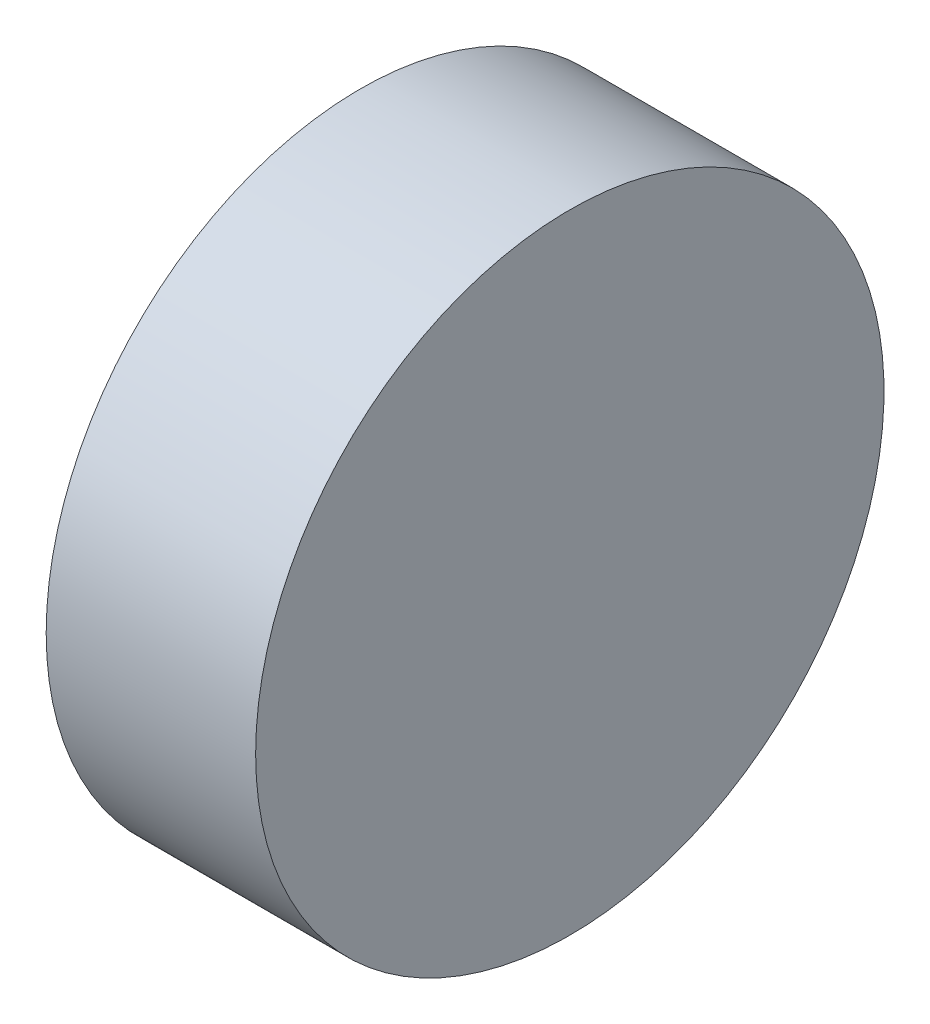
ISO-10303-21;
HEADER;
FILE_DESCRIPTION(('STEP AP214'),'2;1');
FILE_NAME('part.step','',(''),(''),'','','');
FILE_SCHEMA(('AUTOMOTIVE_DESIGN { 1 0 10303 214 1 1 1 1 }'));
ENDSEC;
DATA;
#1=APPLICATION_CONTEXT('core data for automotive mechanical design processes');
#2=APPLICATION_PROTOCOL_DEFINITION('international standard','automotive_design',2000,#1);
#3=PRODUCT_CONTEXT('',#1,'mechanical');
#4=PRODUCT('Part','Part','',(#3));
#5=PRODUCT_RELATED_PRODUCT_CATEGORY('part','',(#4));
#6=PRODUCT_DEFINITION_FORMATION('','',#4);
#7=PRODUCT_DEFINITION_CONTEXT('part definition',#1,'design');
#8=PRODUCT_DEFINITION('design','',#6,#7);
#9=PRODUCT_DEFINITION_SHAPE('','',#8);
#10=(LENGTH_UNIT() NAMED_UNIT(*) SI_UNIT(.MILLI.,.METRE.));
#11=(NAMED_UNIT(*) PLANE_ANGLE_UNIT() SI_UNIT($,.RADIAN.));
#12=(NAMED_UNIT(*) SI_UNIT($,.STERADIAN.) SOLID_ANGLE_UNIT());
#13=UNCERTAINTY_MEASURE_WITH_UNIT(LENGTH_MEASURE(1.E-05),#10,'distance_accuracy_value','');
#14=(GEOMETRIC_REPRESENTATION_CONTEXT(3) GLOBAL_UNCERTAINTY_ASSIGNED_CONTEXT((#13)) GLOBAL_UNIT_ASSIGNED_CONTEXT((#10,
#11,#12)) REPRESENTATION_CONTEXT('',''));
#15=CARTESIAN_POINT('',(0.,0.,0.));
#16=DIRECTION('',(0.,0.,1.));
#17=DIRECTION('',(1.,0.,0.));
#18=AXIS2_PLACEMENT_3D('',#15,#16,#17);
#19=CARTESIAN_POINT('',(270.116303666167,77.2931793490154,0.));
#20=DIRECTION('',(-1.,0.,0.));
#21=DIRECTION('',(0.,0.,1.));
#22=AXIS2_PLACEMENT_3D('',#19,#20,#21);
#23=PLANE('',#22);
#24=CARTESIAN_POINT('',(270.116303666167,77.2931793490154,0.));
#25=DIRECTION('',(-1.,0.,0.));
#26=DIRECTION('',(0.,0.,1.));
#27=AXIS2_PLACEMENT_3D('',#24,#25,#26);
#28=CIRCLE('',#27,15.);
#29=CARTESIAN_POINT('',(270.116303666167,77.2931793490154,15.));
#30=VERTEX_POINT('',#29);
#31=EDGE_CURVE('E10',#30,#30,#28,.T.);
#32=ORIENTED_EDGE('',*,*,#31,.F.);
#33=EDGE_LOOP('',(#32));
#34=FACE_BOUND('',#33,.T.);
#35=ADVANCED_FACE('F35',(#34),#23,.F.);
#36=CARTESIAN_POINT('',(254.000801992616,77.2931793490154,0.));
#37=DIRECTION('',(-1.,0.,0.));
#38=DIRECTION('',(0.,0.,1.));
#39=AXIS2_PLACEMENT_3D('',#36,#37,#38);
#40=CYLINDRICAL_SURFACE('',#39,15.);
#41=CARTESIAN_POINT('',(260.116303666167,77.2931793490154,0.));
#42=DIRECTION('',(-1.,0.,0.));
#43=DIRECTION('',(0.,0.,1.));
#44=AXIS2_PLACEMENT_3D('',#41,#42,#43);
#45=CIRCLE('',#44,15.);
#46=CARTESIAN_POINT('',(260.116303666167,77.2931793490154,15.));
#47=VERTEX_POINT('',#46);
#48=EDGE_CURVE('E41',#47,#47,#45,.T.);
#49=ORIENTED_EDGE('',*,*,#48,.F.);
#50=EDGE_LOOP('',(#49));
#51=FACE_BOUND('',#50,.T.);
#52=ORIENTED_EDGE('',*,*,#31,.T.);
#53=EDGE_LOOP('',(#52));
#54=FACE_BOUND('',#53,.T.);
#55=ADVANCED_FACE('F49',(#51,#54),#40,.T.);
#56=CARTESIAN_POINT('',(260.116303666167,77.2931793490154,0.));
#57=DIRECTION('',(1.,0.,0.));
#58=DIRECTION('',(0.,0.,-1.));
#59=AXIS2_PLACEMENT_3D('',#56,#57,#58);
#60=PLANE('',#59);
#61=ORIENTED_EDGE('',*,*,#48,.T.);
#62=EDGE_LOOP('',(#61));
#63=FACE_BOUND('',#62,.T.);
#64=ADVANCED_FACE('F47',(#63),#60,.F.);
#65=CLOSED_SHELL('',(#35,#55,#64));
#66=MANIFOLD_SOLID_BREP('B2',#65);
#67=ADVANCED_BREP_SHAPE_REPRESENTATION('',(#18,#66),#14);
#68=SHAPE_DEFINITION_REPRESENTATION(#9,#67);
ENDSEC;
END-ISO-10303-21;
